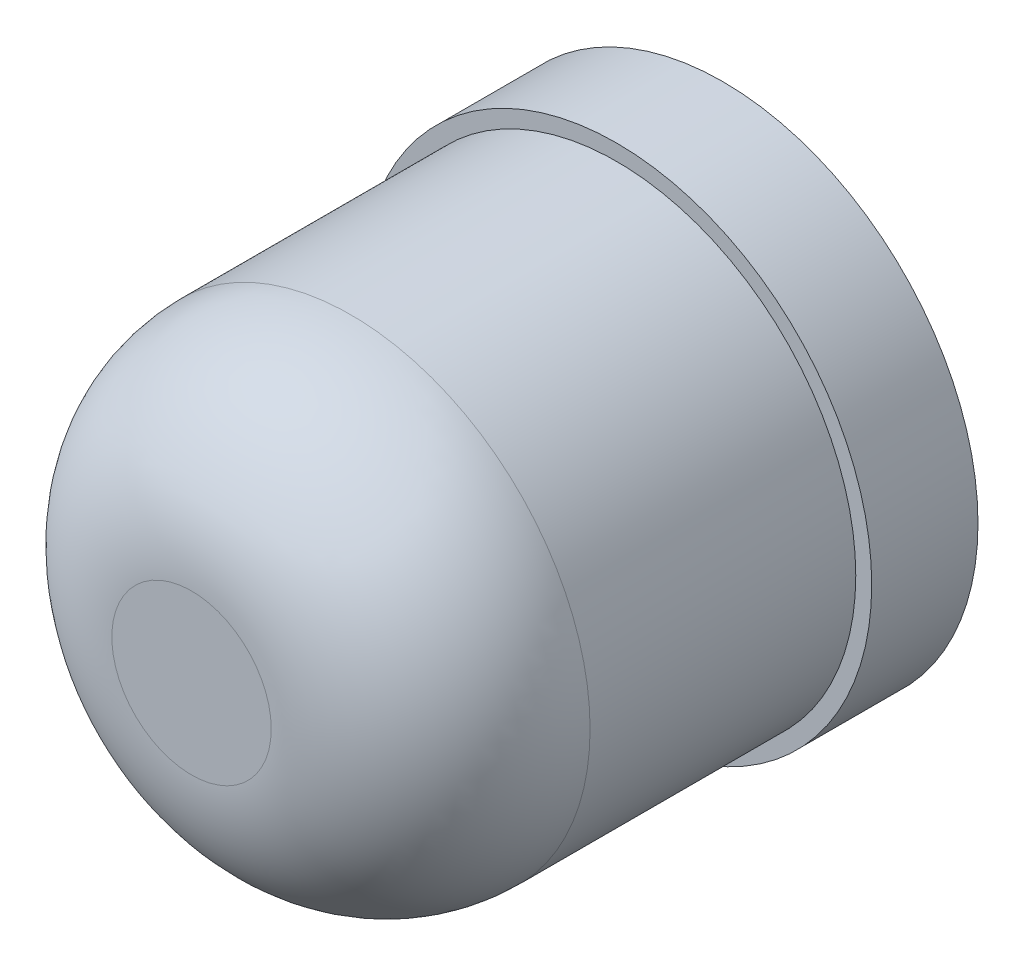
ISO-10303-21;
HEADER;
FILE_DESCRIPTION(('STEP AP214'),'2;1');
FILE_NAME('part.step','',(''),(''),'','','');
FILE_SCHEMA(('AUTOMOTIVE_DESIGN { 1 0 10303 214 1 1 1 1 }'));
ENDSEC;
DATA;
#1=APPLICATION_CONTEXT('core data for automotive mechanical design processes');
#2=APPLICATION_PROTOCOL_DEFINITION('international standard','automotive_design',2000,#1);
#3=PRODUCT_CONTEXT('',#1,'mechanical');
#4=PRODUCT('Part','Part','',(#3));
#5=PRODUCT_RELATED_PRODUCT_CATEGORY('part','',(#4));
#6=PRODUCT_DEFINITION_FORMATION('','',#4);
#7=PRODUCT_DEFINITION_CONTEXT('part definition',#1,'design');
#8=PRODUCT_DEFINITION('design','',#6,#7);
#9=PRODUCT_DEFINITION_SHAPE('','',#8);
#10=(LENGTH_UNIT() NAMED_UNIT(*) SI_UNIT(.MILLI.,.METRE.));
#11=(NAMED_UNIT(*) PLANE_ANGLE_UNIT() SI_UNIT($,.RADIAN.));
#12=(NAMED_UNIT(*) SI_UNIT($,.STERADIAN.) SOLID_ANGLE_UNIT());
#13=UNCERTAINTY_MEASURE_WITH_UNIT(LENGTH_MEASURE(1.E-05),#10,'distance_accuracy_value','');
#14=(GEOMETRIC_REPRESENTATION_CONTEXT(3) GLOBAL_UNCERTAINTY_ASSIGNED_CONTEXT((#13)) GLOBAL_UNIT_ASSIGNED_CONTEXT((#10,
#11,#12)) REPRESENTATION_CONTEXT('',''));
#15=CARTESIAN_POINT('',(0.,0.,0.));
#16=DIRECTION('',(0.,0.,1.));
#17=DIRECTION('',(1.,0.,0.));
#18=AXIS2_PLACEMENT_3D('',#15,#16,#17);
#19=CARTESIAN_POINT('',(0.,4.95701590446812,4.));
#20=DIRECTION('',(0.,0.,-1.));
#21=DIRECTION('',(-1.,0.,0.));
#22=AXIS2_PLACEMENT_3D('',#19,#20,#21);
#23=CYLINDRICAL_SURFACE('',#22,2.25);
#24=CARTESIAN_POINT('',(0.,4.95701590446812,2.5));
#25=DIRECTION('',(0.,0.,1.));
#26=DIRECTION('',(1.,0.,0.));
#27=AXIS2_PLACEMENT_3D('',#24,#25,#26);
#28=CIRCLE('',#27,2.25);
#29=CARTESIAN_POINT('',(2.25,4.95701590446812,2.5));
#30=VERTEX_POINT('',#29);
#31=EDGE_CURVE('E10',#30,#30,#28,.F.);
#32=ORIENTED_EDGE('',*,*,#31,.T.);
#33=EDGE_LOOP('',(#32));
#34=FACE_BOUND('',#33,.T.);
#35=CARTESIAN_POINT('',(0.,4.95701590446812,0.));
#36=DIRECTION('',(0.,0.,1.));
#37=DIRECTION('',(1.,0.,0.));
#38=AXIS2_PLACEMENT_3D('',#35,#36,#37);
#39=CIRCLE('',#38,2.25);
#40=CARTESIAN_POINT('',(2.25,4.95701590446812,0.));
#41=VERTEX_POINT('',#40);
#42=EDGE_CURVE('E42',#41,#41,#39,.T.);
#43=ORIENTED_EDGE('',*,*,#42,.T.);
#44=EDGE_LOOP('',(#43));
#45=FACE_BOUND('',#44,.T.);
#46=ADVANCED_FACE('F31',(#34,#45),#23,.T.);
#47=CARTESIAN_POINT('',(0.,4.95701590446812,4.));
#48=DIRECTION('',(0.,0.,1.));
#49=DIRECTION('',(1.,0.,0.));
#50=AXIS2_PLACEMENT_3D('',#47,#48,#49);
#51=PLANE('',#50);
#52=CARTESIAN_POINT('',(0.,4.95701590446812,4.));
#53=DIRECTION('',(0.,0.,1.));
#54=DIRECTION('',(1.,0.,0.));
#55=AXIS2_PLACEMENT_3D('',#52,#53,#54);
#56=CIRCLE('',#55,0.75);
#57=CARTESIAN_POINT('',(0.75,4.95701590446812,4.));
#58=VERTEX_POINT('',#57);
#59=EDGE_CURVE('E38',#58,#58,#56,.T.);
#60=ORIENTED_EDGE('',*,*,#59,.T.);
#61=EDGE_LOOP('',(#60));
#62=FACE_BOUND('',#61,.T.);
#63=ADVANCED_FACE('F60',(#62),#51,.T.);
#64=CARTESIAN_POINT('',(0.,4.95701590446812,-1.));
#65=DIRECTION('',(0.,0.,1.));
#66=DIRECTION('',(1.,0.,0.));
#67=AXIS2_PLACEMENT_3D('',#64,#65,#66);
#68=CYLINDRICAL_SURFACE('',#67,2.4);
#69=CARTESIAN_POINT('',(0.,4.95701590446812,-1.));
#70=DIRECTION('',(0.,0.,-1.));
#71=DIRECTION('',(-1.,0.,0.));
#72=AXIS2_PLACEMENT_3D('',#69,#70,#71);
#73=CIRCLE('',#72,2.4);
#74=CARTESIAN_POINT('',(-2.4,4.95701590446812,-1.));
#75=VERTEX_POINT('',#74);
#76=EDGE_CURVE('E46',#75,#75,#73,.T.);
#77=ORIENTED_EDGE('',*,*,#76,.F.);
#78=EDGE_LOOP('',(#77));
#79=FACE_BOUND('',#78,.T.);
#80=CARTESIAN_POINT('',(0.,4.95701590446812,0.));
#81=DIRECTION('',(0.,0.,-1.));
#82=DIRECTION('',(-1.,0.,0.));
#83=AXIS2_PLACEMENT_3D('',#80,#81,#82);
#84=CIRCLE('',#83,2.4);
#85=CARTESIAN_POINT('',(-2.4,4.95701590446812,0.));
#86=VERTEX_POINT('',#85);
#87=EDGE_CURVE('E49',#86,#86,#84,.T.);
#88=ORIENTED_EDGE('',*,*,#87,.T.);
#89=EDGE_LOOP('',(#88));
#90=FACE_BOUND('',#89,.T.);
#91=ADVANCED_FACE('F57',(#79,#90),#68,.T.);
#92=CARTESIAN_POINT('',(0.,4.95701590446812,-1.));
#93=DIRECTION('',(0.,0.,-1.));
#94=DIRECTION('',(-1.,0.,0.));
#95=AXIS2_PLACEMENT_3D('',#92,#93,#94);
#96=PLANE('',#95);
#97=ORIENTED_EDGE('',*,*,#76,.T.);
#98=EDGE_LOOP('',(#97));
#99=FACE_BOUND('',#98,.T.);
#100=ADVANCED_FACE('F55',(#99),#96,.T.);
#101=CARTESIAN_POINT('',(0.,4.95701590446812,0.));
#102=DIRECTION('',(0.,0.,-1.));
#103=DIRECTION('',(-1.,0.,0.));
#104=AXIS2_PLACEMENT_3D('',#101,#102,#103);
#105=PLANE('',#104);
#106=ORIENTED_EDGE('',*,*,#42,.F.);
#107=EDGE_LOOP('',(#106));
#108=FACE_BOUND('',#107,.T.);
#109=ORIENTED_EDGE('',*,*,#87,.F.);
#110=EDGE_LOOP('',(#109));
#111=FACE_BOUND('',#110,.T.);
#112=ADVANCED_FACE('F64',(#108,#111),#105,.F.);
#113=CARTESIAN_POINT('',(0.,4.95701590446812,2.5));
#114=DIRECTION('',(0.,0.,1.));
#115=DIRECTION('',(1.,0.,0.));
#116=AXIS2_PLACEMENT_3D('',#113,#114,#115);
#117=DEGENERATE_TOROIDAL_SURFACE('',#116,0.75,1.5,.T.);
#118=ORIENTED_EDGE('',*,*,#31,.F.);
#119=EDGE_LOOP('',(#118));
#120=FACE_BOUND('',#119,.T.);
#121=ORIENTED_EDGE('',*,*,#59,.F.);
#122=EDGE_LOOP('',(#121));
#123=FACE_BOUND('',#122,.T.);
#124=ADVANCED_FACE('F33',(#120,#123),#117,.T.);
#125=CLOSED_SHELL('',(#46,#63,#91,#100,#112,#124));
#126=MANIFOLD_SOLID_BREP('B2',#125);
#127=ADVANCED_BREP_SHAPE_REPRESENTATION('',(#18,#126),#14);
#128=SHAPE_DEFINITION_REPRESENTATION(#9,#127);
ENDSEC;
END-ISO-10303-21;
